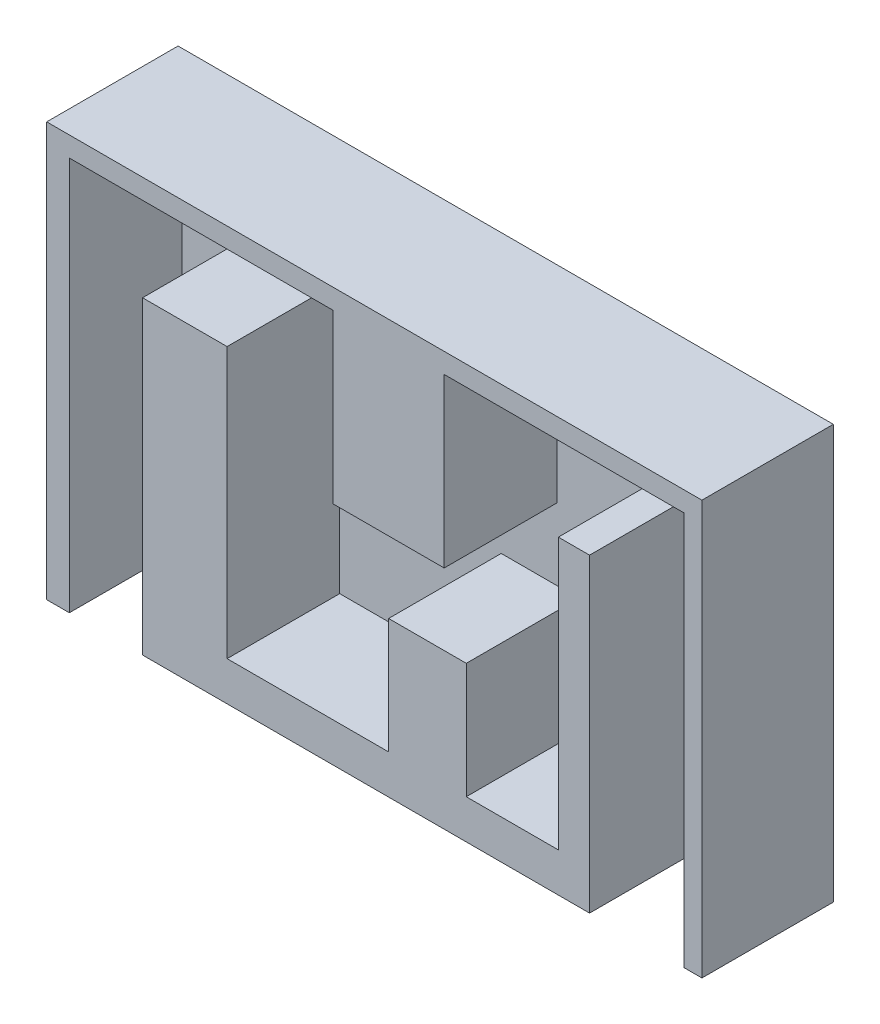
ISO-10303-21;
HEADER;
FILE_DESCRIPTION(('STEP AP214'),'2;1');
FILE_NAME('part.step','',(''),(''),'','','');
FILE_SCHEMA(('AUTOMOTIVE_DESIGN { 1 0 10303 214 1 1 1 1 }'));
ENDSEC;
DATA;
#1=APPLICATION_CONTEXT('core data for automotive mechanical design processes');
#2=APPLICATION_PROTOCOL_DEFINITION('international standard','automotive_design',2000,#1);
#3=PRODUCT_CONTEXT('',#1,'mechanical');
#4=PRODUCT('Part','Part','',(#3));
#5=PRODUCT_RELATED_PRODUCT_CATEGORY('part','',(#4));
#6=PRODUCT_DEFINITION_FORMATION('','',#4);
#7=PRODUCT_DEFINITION_CONTEXT('part definition',#1,'design');
#8=PRODUCT_DEFINITION('design','',#6,#7);
#9=PRODUCT_DEFINITION_SHAPE('','',#8);
#10=(LENGTH_UNIT() NAMED_UNIT(*) SI_UNIT(.MILLI.,.METRE.));
#11=(NAMED_UNIT(*) PLANE_ANGLE_UNIT() SI_UNIT($,.RADIAN.));
#12=(NAMED_UNIT(*) SI_UNIT($,.STERADIAN.) SOLID_ANGLE_UNIT());
#13=UNCERTAINTY_MEASURE_WITH_UNIT(LENGTH_MEASURE(1.E-05),#10,'distance_accuracy_value','');
#14=(GEOMETRIC_REPRESENTATION_CONTEXT(3) GLOBAL_UNCERTAINTY_ASSIGNED_CONTEXT((#13)) GLOBAL_UNIT_ASSIGNED_CONTEXT((#10,
#11,#12)) REPRESENTATION_CONTEXT('',''));
#15=CARTESIAN_POINT('',(0.,0.,0.));
#16=DIRECTION('',(0.,0.,1.));
#17=DIRECTION('',(1.,0.,0.));
#18=AXIS2_PLACEMENT_3D('',#15,#16,#17);
#19=CARTESIAN_POINT('',(0.,0.,500.));
#20=DIRECTION('',(0.,0.,1.));
#21=DIRECTION('',(1.,0.,0.));
#22=AXIS2_PLACEMENT_3D('',#19,#20,#21);
#23=PLANE('',#22);
#24=DIRECTION('',(1.,0.,0.));
#25=VECTOR('',#24,1.);
#26=CARTESIAN_POINT('',(-8052.537291545,-6025.89200004877,500.));
#27=LINE('',#26,#25);
#28=CARTESIAN_POINT('',(-7448.80738329557,-6025.89200004877,500.));
#29=VERTEX_POINT('',#28);
#30=CARTESIAN_POINT('',(-5498.847673456,-6025.89200004877,500.));
#31=VERTEX_POINT('',#30);
#32=EDGE_CURVE('E314',#29,#31,#27,.T.);
#33=ORIENTED_EDGE('',*,*,#32,.T.);
#34=DIRECTION('',(0.,-1.,0.));
#35=VECTOR('',#34,1.);
#36=CARTESIAN_POINT('',(-5498.847673456,-6025.89200004877,500.));
#37=LINE('',#36,#35);
#38=CARTESIAN_POINT('',(-5498.847673456,2217.4300417054,500.));
#39=VERTEX_POINT('',#38);
#40=EDGE_CURVE('E220',#39,#31,#37,.T.);
#41=ORIENTED_EDGE('',*,*,#40,.F.);
#42=DIRECTION('',(-1.,0.,0.));
#43=VECTOR('',#42,1.);
#44=CARTESIAN_POINT('',(-5498.847673456,2217.4300417054,500.));
#45=LINE('',#44,#43);
#46=CARTESIAN_POINT('',(-3246.47736203018,2217.4300417054,500.));
#47=VERTEX_POINT('',#46);
#48=EDGE_CURVE('E216',#47,#39,#45,.T.);
#49=ORIENTED_EDGE('',*,*,#48,.F.);
#50=DIRECTION('',(0.,1.,0.));
#51=VECTOR('',#50,1.);
#52=CARTESIAN_POINT('',(-3246.47736203018,-4983.03292566058,500.));
#53=LINE('',#52,#51);
#54=CARTESIAN_POINT('',(-3246.47736203018,-4983.03292566058,500.));
#55=VERTEX_POINT('',#54);
#56=EDGE_CURVE('E565',#55,#47,#53,.T.);
#57=ORIENTED_EDGE('',*,*,#56,.F.);
#58=DIRECTION('',(-1.,0.,0.));
#59=VECTOR('',#58,1.);
#60=CARTESIAN_POINT('',(-3246.47736203018,-4983.03292566058,500.));
#61=LINE('',#60,#59);
#62=CARTESIAN_POINT('',(1056.62484068523,-4983.03292566058,500.));
#63=VERTEX_POINT('',#62);
#64=EDGE_CURVE('E586',#63,#55,#61,.T.);
#65=ORIENTED_EDGE('',*,*,#64,.F.);
#66=DIRECTION('',(0.,-1.,0.));
#67=VECTOR('',#66,1.);
#68=CARTESIAN_POINT('',(1056.62484068523,-4983.03292566058,500.));
#69=LINE('',#68,#67);
#70=CARTESIAN_POINT('',(1056.62484068523,-1904.23097917169,500.));
#71=VERTEX_POINT('',#70);
#72=EDGE_CURVE('E584',#71,#63,#69,.T.);
#73=ORIENTED_EDGE('',*,*,#72,.F.);
#74=DIRECTION('',(-1.,0.,0.));
#75=VECTOR('',#74,1.);
#76=CARTESIAN_POINT('',(1056.62484068523,-1904.23097917169,500.));
#77=LINE('',#76,#75);
#78=CARTESIAN_POINT('',(3125.30623179592,-1904.23097917169,500.));
#79=VERTEX_POINT('',#78);
#80=EDGE_CURVE('E582',#79,#71,#77,.T.);
#81=ORIENTED_EDGE('',*,*,#80,.F.);
#82=DIRECTION('',(0.,1.,0.));
#83=VECTOR('',#82,1.);
#84=CARTESIAN_POINT('',(3125.30623179592,-4983.03292566058,500.));
#85=LINE('',#84,#83);
#86=CARTESIAN_POINT('',(3125.30623179592,-4983.03292566058,500.));
#87=VERTEX_POINT('',#86);
#88=EDGE_CURVE('E580',#87,#79,#85,.T.);
#89=ORIENTED_EDGE('',*,*,#88,.F.);
#90=DIRECTION('',(-1.,0.,0.));
#91=VECTOR('',#90,1.);
#92=CARTESIAN_POINT('',(3125.30623179592,-4983.03292566058,500.));
#93=LINE('',#92,#91);
#94=CARTESIAN_POINT('',(5578.01974125755,-4983.03292566058,500.));
#95=VERTEX_POINT('',#94);
#96=EDGE_CURVE('E578',#95,#87,#93,.T.);
#97=ORIENTED_EDGE('',*,*,#96,.F.);
#98=DIRECTION('',(0.,-1.,0.));
#99=VECTOR('',#98,1.);
#100=CARTESIAN_POINT('',(5578.01974125755,-4983.03292566058,500.));
#101=LINE('',#100,#99);
#102=CARTESIAN_POINT('',(5578.01974125755,2233.23141171473,500.));
#103=VERTEX_POINT('',#102);
#104=EDGE_CURVE('E576',#103,#95,#101,.T.);
#105=ORIENTED_EDGE('',*,*,#104,.F.);
#106=DIRECTION('',(-1.,0.,0.));
#107=VECTOR('',#106,1.);
#108=CARTESIAN_POINT('',(6409.75472553788,2233.23141171473,500.));
#109=LINE('',#108,#107);
#110=CARTESIAN_POINT('',(6409.75472553788,2233.23141171473,500.));
#111=VERTEX_POINT('',#110);
#112=EDGE_CURVE('E570',#111,#103,#109,.T.);
#113=ORIENTED_EDGE('',*,*,#112,.F.);
#114=DIRECTION('',(0.,1.,0.));
#115=VECTOR('',#114,1.);
#116=CARTESIAN_POINT('',(6409.75472553788,-4983.03292566058,500.));
#117=LINE('',#116,#115);
#118=CARTESIAN_POINT('',(6409.75472553788,-6025.89200004877,500.));
#119=VERTEX_POINT('',#118);
#120=EDGE_CURVE('E568',#119,#111,#117,.T.);
#121=ORIENTED_EDGE('',*,*,#120,.F.);
#122=CARTESIAN_POINT('',(8924.38870667759,-6025.89200004877,500.));
#123=VERTEX_POINT('',#122);
#124=EDGE_CURVE('E36',#119,#123,#27,.T.);
#125=ORIENTED_EDGE('',*,*,#124,.T.);
#126=DIRECTION('',(0.,-1.,0.));
#127=VECTOR('',#126,1.);
#128=CARTESIAN_POINT('',(8924.38870667759,4466.46282342947,500.));
#129=LINE('',#128,#127);
#130=CARTESIAN_POINT('',(8924.38870667759,4466.46282342947,500.));
#131=VERTEX_POINT('',#130);
#132=EDGE_CURVE('E58',#131,#123,#129,.T.);
#133=ORIENTED_EDGE('',*,*,#132,.F.);
#134=DIRECTION('',(1.,0.,0.));
#135=VECTOR('',#134,1.);
#136=CARTESIAN_POINT('',(2536.68679127433,4466.46282342947,500.));
#137=LINE('',#136,#135);
#138=CARTESIAN_POINT('',(2536.68679127433,4466.46282342947,500.));
#139=VERTEX_POINT('',#138);
#140=EDGE_CURVE('E271',#139,#131,#137,.T.);
#141=ORIENTED_EDGE('',*,*,#140,.F.);
#142=DIRECTION('',(0.,1.,0.));
#143=VECTOR('',#142,1.);
#144=CARTESIAN_POINT('',(2536.68679127433,4466.46282342947,500.));
#145=LINE('',#144,#143);
#146=CARTESIAN_POINT('',(2536.68679127433,0.,500.));
#147=VERTEX_POINT('',#146);
#148=EDGE_CURVE('E268',#147,#139,#145,.T.);
#149=ORIENTED_EDGE('',*,*,#148,.F.);
#150=DIRECTION('',(1.,0.,0.));
#151=VECTOR('',#150,1.);
#152=CARTESIAN_POINT('',(-423.437109903873,0.,500.));
#153=LINE('',#152,#151);
#154=CARTESIAN_POINT('',(-423.437109903873,0.,500.));
#155=VERTEX_POINT('',#154);
#156=EDGE_CURVE('E265',#155,#147,#153,.T.);
#157=ORIENTED_EDGE('',*,*,#156,.F.);
#158=DIRECTION('',(0.,-1.,0.));
#159=VECTOR('',#158,1.);
#160=CARTESIAN_POINT('',(-423.437109903873,4466.46282342947,500.));
#161=LINE('',#160,#159);
#162=CARTESIAN_POINT('',(-423.437109903873,4466.46282342947,500.));
#163=VERTEX_POINT('',#162);
#164=EDGE_CURVE('E262',#163,#155,#161,.T.);
#165=ORIENTED_EDGE('',*,*,#164,.F.);
#166=DIRECTION('',(1.,0.,0.));
#167=VECTOR('',#166,1.);
#168=CARTESIAN_POINT('',(-7448.80738329557,4466.46282342947,500.));
#169=LINE('',#168,#167);
#170=CARTESIAN_POINT('',(-7448.80738329557,4466.46282342947,500.));
#171=VERTEX_POINT('',#170);
#172=EDGE_CURVE('E225',#171,#163,#169,.T.);
#173=ORIENTED_EDGE('',*,*,#172,.F.);
#174=DIRECTION('',(0.,1.,0.));
#175=VECTOR('',#174,1.);
#176=CARTESIAN_POINT('',(-7448.80738329557,-6025.89200004877,500.));
#177=LINE('',#176,#175);
#178=EDGE_CURVE('E222',#29,#171,#177,.T.);
#179=ORIENTED_EDGE('',*,*,#178,.F.);
#180=EDGE_LOOP('',(#33,#41,#49,#57,#65,#73,#81,#89,#97,#105,#113,#121,#125,#133,#141,#149,#157,
#165,#173,#179));
#181=FACE_BOUND('',#180,.T.);
#182=ADVANCED_FACE('F32',(#181),#23,.T.);
#183=CARTESIAN_POINT('',(-8052.537291545,4999.05838569069,500.));
#184=DIRECTION('',(1.,0.,0.));
#185=DIRECTION('',(0.,0.,-1.));
#186=AXIS2_PLACEMENT_3D('',#183,#184,#185);
#187=PLANE('',#186);
#188=DIRECTION('',(0.,-1.,0.));
#189=VECTOR('',#188,1.);
#190=CARTESIAN_POINT('',(-8052.537291545,4999.05838569069,0.));
#191=LINE('',#190,#189);
#192=CARTESIAN_POINT('',(-8052.537291545,4999.05838569069,0.));
#193=VERTEX_POINT('',#192);
#194=CARTESIAN_POINT('',(-8052.537291545,-6025.89200004877,0.));
#195=VERTEX_POINT('',#194);
#196=EDGE_CURVE('E310',#193,#195,#191,.T.);
#197=ORIENTED_EDGE('',*,*,#196,.T.);
#198=DIRECTION('',(0.,0.,-1.));
#199=VECTOR('',#198,1.);
#200=CARTESIAN_POINT('',(-8052.537291545,-6025.89200004877,500.));
#201=LINE('',#200,#199);
#202=CARTESIAN_POINT('',(-8052.537291545,-6025.89200004877,3500.));
#203=VERTEX_POINT('',#202);
#204=EDGE_CURVE('E11',#203,#195,#201,.T.);
#205=ORIENTED_EDGE('',*,*,#204,.F.);
#206=DIRECTION('',(0.,-1.,0.));
#207=VECTOR('',#206,1.);
#208=CARTESIAN_POINT('',(-8052.537291545,-6025.89200004877,3500.));
#209=LINE('',#208,#207);
#210=CARTESIAN_POINT('',(-8052.537291545,4999.05838569069,3500.));
#211=VERTEX_POINT('',#210);
#212=EDGE_CURVE('E231',#211,#203,#209,.T.);
#213=ORIENTED_EDGE('',*,*,#212,.F.);
#214=DIRECTION('',(0.,0.,-1.));
#215=VECTOR('',#214,1.);
#216=CARTESIAN_POINT('',(-8052.537291545,4999.05838569069,500.));
#217=LINE('',#216,#215);
#218=EDGE_CURVE('E315',#211,#193,#217,.T.);
#219=ORIENTED_EDGE('',*,*,#218,.T.);
#220=EDGE_LOOP('',(#197,#205,#213,#219));
#221=FACE_BOUND('',#220,.T.);
#222=ADVANCED_FACE('F34',(#221),#187,.F.);
#223=CARTESIAN_POINT('',(-8052.537291545,-6025.89200004877,500.));
#224=DIRECTION('',(0.,1.,0.));
#225=DIRECTION('',(0.,0.,1.));
#226=AXIS2_PLACEMENT_3D('',#223,#224,#225);
#227=PLANE('',#226);
#228=DIRECTION('',(1.,0.,0.));
#229=VECTOR('',#228,1.);
#230=CARTESIAN_POINT('',(-8052.537291545,-6025.89200004877,0.));
#231=LINE('',#230,#229);
#232=CARTESIAN_POINT('',(9403.63415254248,-6025.89200004877,0.));
#233=VERTEX_POINT('',#232);
#234=EDGE_CURVE('E324',#195,#233,#231,.T.);
#235=ORIENTED_EDGE('',*,*,#234,.T.);
#236=DIRECTION('',(0.,0.,-1.));
#237=VECTOR('',#236,1.);
#238=CARTESIAN_POINT('',(9403.63415254248,-6025.89200004877,500.));
#239=LINE('',#238,#237);
#240=CARTESIAN_POINT('',(9403.63415254248,-6025.89200004877,3500.));
#241=VERTEX_POINT('',#240);
#242=EDGE_CURVE('E42',#241,#233,#239,.T.);
#243=ORIENTED_EDGE('',*,*,#242,.F.);
#244=DIRECTION('',(1.,0.,0.));
#245=VECTOR('',#244,1.);
#246=CARTESIAN_POINT('',(9403.63415254248,-6025.89200004877,3500.));
#247=LINE('',#246,#245);
#248=CARTESIAN_POINT('',(8924.38870667759,-6025.89200004877,3500.));
#249=VERTEX_POINT('',#248);
#250=EDGE_CURVE('E250',#249,#241,#247,.T.);
#251=ORIENTED_EDGE('',*,*,#250,.F.);
#252=DIRECTION('',(0.,0.,-1.));
#253=VECTOR('',#252,1.);
#254=CARTESIAN_POINT('',(8924.38870667759,-6025.89200004877,3500.));
#255=LINE('',#254,#253);
#256=EDGE_CURVE('E259',#249,#123,#255,.T.);
#257=ORIENTED_EDGE('',*,*,#256,.T.);
#258=ORIENTED_EDGE('',*,*,#124,.F.);
#259=DIRECTION('',(0.,0.,-1.));
#260=VECTOR('',#259,1.);
#261=CARTESIAN_POINT('',(6409.75472553788,-6025.89200004877,3500.));
#262=LINE('',#261,#260);
#263=CARTESIAN_POINT('',(6409.75472553788,-6025.89200004877,3500.));
#264=VERTEX_POINT('',#263);
#265=EDGE_CURVE('E204',#264,#119,#262,.T.);
#266=ORIENTED_EDGE('',*,*,#265,.F.);
#267=DIRECTION('',(1.,0.,0.));
#268=VECTOR('',#267,1.);
#269=CARTESIAN_POINT('',(-5498.847673456,-6025.89200004877,3500.));
#270=LINE('',#269,#268);
#271=CARTESIAN_POINT('',(-5498.847673456,-6025.89200004877,3500.));
#272=VERTEX_POINT('',#271);
#273=EDGE_CURVE('E196',#272,#264,#270,.T.);
#274=ORIENTED_EDGE('',*,*,#273,.F.);
#275=DIRECTION('',(0.,0.,-1.));
#276=VECTOR('',#275,1.);
#277=CARTESIAN_POINT('',(-5498.847673456,-6025.89200004877,3500.));
#278=LINE('',#277,#276);
#279=EDGE_CURVE('E201',#272,#31,#278,.T.);
#280=ORIENTED_EDGE('',*,*,#279,.T.);
#281=ORIENTED_EDGE('',*,*,#32,.F.);
#282=DIRECTION('',(0.,0.,-1.));
#283=VECTOR('',#282,1.);
#284=CARTESIAN_POINT('',(-7448.80738329557,-6025.89200004877,3500.));
#285=LINE('',#284,#283);
#286=CARTESIAN_POINT('',(-7448.80738329557,-6025.89200004877,3500.));
#287=VERTEX_POINT('',#286);
#288=EDGE_CURVE('E307',#287,#29,#285,.T.);
#289=ORIENTED_EDGE('',*,*,#288,.F.);
#290=DIRECTION('',(1.,0.,0.));
#291=VECTOR('',#290,1.);
#292=CARTESIAN_POINT('',(-8052.537291545,-6025.89200004877,3500.));
#293=LINE('',#292,#291);
#294=EDGE_CURVE('E234',#203,#287,#293,.T.);
#295=ORIENTED_EDGE('',*,*,#294,.F.);
#296=ORIENTED_EDGE('',*,*,#204,.T.);
#297=EDGE_LOOP('',(#235,#243,#251,#257,#258,#266,#274,#280,#281,#289,#295,#296));
#298=FACE_BOUND('',#297,.T.);
#299=ADVANCED_FACE('F198',(#298),#227,.F.);
#300=CARTESIAN_POINT('',(9403.63415254248,4999.05838569069,500.));
#301=DIRECTION('',(-1.,0.,0.));
#302=DIRECTION('',(0.,0.,1.));
#303=AXIS2_PLACEMENT_3D('',#300,#301,#302);
#304=PLANE('',#303);
#305=DIRECTION('',(0.,1.,0.));
#306=VECTOR('',#305,1.);
#307=CARTESIAN_POINT('',(9403.63415254248,4999.05838569069,0.));
#308=LINE('',#307,#306);
#309=CARTESIAN_POINT('',(9403.63415254248,4999.05838569069,0.));
#310=VERTEX_POINT('',#309);
#311=EDGE_CURVE('E328',#233,#310,#308,.T.);
#312=ORIENTED_EDGE('',*,*,#311,.T.);
#313=DIRECTION('',(0.,0.,-1.));
#314=VECTOR('',#313,1.);
#315=CARTESIAN_POINT('',(9403.63415254248,4999.05838569069,500.));
#316=LINE('',#315,#314);
#317=CARTESIAN_POINT('',(9403.63415254248,4999.05838569069,3500.));
#318=VERTEX_POINT('',#317);
#319=EDGE_CURVE('E335',#318,#310,#316,.T.);
#320=ORIENTED_EDGE('',*,*,#319,.F.);
#321=DIRECTION('',(0.,1.,0.));
#322=VECTOR('',#321,1.);
#323=CARTESIAN_POINT('',(9403.63415254248,4466.46282342947,3500.));
#324=LINE('',#323,#322);
#325=EDGE_CURVE('E253',#241,#318,#324,.T.);
#326=ORIENTED_EDGE('',*,*,#325,.F.);
#327=ORIENTED_EDGE('',*,*,#242,.T.);
#328=EDGE_LOOP('',(#312,#320,#326,#327));
#329=FACE_BOUND('',#328,.T.);
#330=ADVANCED_FACE('F340',(#329),#304,.F.);
#331=CARTESIAN_POINT('',(-8052.537291545,4999.05838569069,500.));
#332=DIRECTION('',(0.,-1.,0.));
#333=DIRECTION('',(0.,0.,-1.));
#334=AXIS2_PLACEMENT_3D('',#331,#332,#333);
#335=PLANE('',#334);
#336=DIRECTION('',(-1.,0.,0.));
#337=VECTOR('',#336,1.);
#338=CARTESIAN_POINT('',(-8052.537291545,4999.05838569069,0.));
#339=LINE('',#338,#337);
#340=EDGE_CURVE('E330',#310,#193,#339,.T.);
#341=ORIENTED_EDGE('',*,*,#340,.T.);
#342=ORIENTED_EDGE('',*,*,#218,.F.);
#343=DIRECTION('',(-1.,0.,0.));
#344=VECTOR('',#343,1.);
#345=CARTESIAN_POINT('',(-7448.80738329557,4999.05838569069,3500.));
#346=LINE('',#345,#344);
#347=EDGE_CURVE('E256',#318,#211,#346,.T.);
#348=ORIENTED_EDGE('',*,*,#347,.F.);
#349=ORIENTED_EDGE('',*,*,#319,.T.);
#350=EDGE_LOOP('',(#341,#342,#348,#349));
#351=FACE_BOUND('',#350,.T.);
#352=ADVANCED_FACE('F345',(#351),#335,.F.);
#353=CARTESIAN_POINT('',(0.,0.,0.));
#354=DIRECTION('',(0.,0.,1.));
#355=DIRECTION('',(1.,0.,0.));
#356=AXIS2_PLACEMENT_3D('',#353,#354,#355);
#357=PLANE('',#356);
#358=ORIENTED_EDGE('',*,*,#196,.F.);
#359=ORIENTED_EDGE('',*,*,#340,.F.);
#360=ORIENTED_EDGE('',*,*,#311,.F.);
#361=ORIENTED_EDGE('',*,*,#234,.F.);
#362=EDGE_LOOP('',(#358,#359,#360,#361));
#363=FACE_BOUND('',#362,.T.);
#364=ADVANCED_FACE('F343',(#363),#357,.F.);
#365=CARTESIAN_POINT('',(-7448.80738329557,-6025.89200004877,3500.));
#366=DIRECTION('',(-1.,0.,0.));
#367=DIRECTION('',(0.,0.,1.));
#368=AXIS2_PLACEMENT_3D('',#365,#366,#367);
#369=PLANE('',#368);
#370=ORIENTED_EDGE('',*,*,#178,.T.);
#371=DIRECTION('',(0.,0.,-1.));
#372=VECTOR('',#371,1.);
#373=CARTESIAN_POINT('',(-7448.80738329557,4466.46282342947,3500.));
#374=LINE('',#373,#372);
#375=CARTESIAN_POINT('',(-7448.80738329557,4466.46282342947,3500.));
#376=VERTEX_POINT('',#375);
#377=EDGE_CURVE('E305',#376,#171,#374,.T.);
#378=ORIENTED_EDGE('',*,*,#377,.F.);
#379=DIRECTION('',(0.,1.,0.));
#380=VECTOR('',#379,1.);
#381=CARTESIAN_POINT('',(-7448.80738329557,-6025.89200004877,3500.));
#382=LINE('',#381,#380);
#383=EDGE_CURVE('E236',#287,#376,#382,.T.);
#384=ORIENTED_EDGE('',*,*,#383,.F.);
#385=ORIENTED_EDGE('',*,*,#288,.T.);
#386=EDGE_LOOP('',(#370,#378,#384,#385));
#387=FACE_BOUND('',#386,.T.);
#388=ADVANCED_FACE('F369',(#387),#369,.F.);
#389=CARTESIAN_POINT('',(-7448.80738329557,4466.46282342947,3500.));
#390=DIRECTION('',(0.,1.,0.));
#391=DIRECTION('',(0.,0.,1.));
#392=AXIS2_PLACEMENT_3D('',#389,#390,#391);
#393=PLANE('',#392);
#394=ORIENTED_EDGE('',*,*,#172,.T.);
#395=DIRECTION('',(0.,0.,-1.));
#396=VECTOR('',#395,1.);
#397=CARTESIAN_POINT('',(-423.437109903873,4466.46282342947,3500.));
#398=LINE('',#397,#396);
#399=CARTESIAN_POINT('',(-423.437109903873,4466.46282342947,3500.));
#400=VERTEX_POINT('',#399);
#401=EDGE_CURVE('E302',#400,#163,#398,.T.);
#402=ORIENTED_EDGE('',*,*,#401,.F.);
#403=DIRECTION('',(1.,0.,0.));
#404=VECTOR('',#403,1.);
#405=CARTESIAN_POINT('',(-7448.80738329557,4466.46282342947,3500.));
#406=LINE('',#405,#404);
#407=EDGE_CURVE('E238',#376,#400,#406,.T.);
#408=ORIENTED_EDGE('',*,*,#407,.F.);
#409=ORIENTED_EDGE('',*,*,#377,.T.);
#410=EDGE_LOOP('',(#394,#402,#408,#409));
#411=FACE_BOUND('',#410,.T.);
#412=ADVANCED_FACE('F399',(#411),#393,.F.);
#413=CARTESIAN_POINT('',(-423.437109903873,4466.46282342947,3500.));
#414=DIRECTION('',(1.,0.,0.));
#415=DIRECTION('',(0.,0.,-1.));
#416=AXIS2_PLACEMENT_3D('',#413,#414,#415);
#417=PLANE('',#416);
#418=ORIENTED_EDGE('',*,*,#164,.T.);
#419=DIRECTION('',(0.,0.,-1.));
#420=VECTOR('',#419,1.);
#421=CARTESIAN_POINT('',(-423.437109903873,0.,3500.));
#422=LINE('',#421,#420);
#423=CARTESIAN_POINT('',(-423.437109903873,0.,3500.));
#424=VERTEX_POINT('',#423);
#425=EDGE_CURVE('E297',#424,#155,#422,.T.);
#426=ORIENTED_EDGE('',*,*,#425,.F.);
#427=DIRECTION('',(0.,-1.,0.));
#428=VECTOR('',#427,1.);
#429=CARTESIAN_POINT('',(-423.437109903873,4466.46282342947,3500.));
#430=LINE('',#429,#428);
#431=EDGE_CURVE('E240',#400,#424,#430,.T.);
#432=ORIENTED_EDGE('',*,*,#431,.F.);
#433=ORIENTED_EDGE('',*,*,#401,.T.);
#434=EDGE_LOOP('',(#418,#426,#432,#433));
#435=FACE_BOUND('',#434,.T.);
#436=ADVANCED_FACE('F405',(#435),#417,.F.);
#437=CARTESIAN_POINT('',(-423.437109903873,0.,3500.));
#438=DIRECTION('',(0.,1.,0.));
#439=DIRECTION('',(0.,0.,1.));
#440=AXIS2_PLACEMENT_3D('',#437,#438,#439);
#441=PLANE('',#440);
#442=ORIENTED_EDGE('',*,*,#156,.T.);
#443=DIRECTION('',(0.,0.,-1.));
#444=VECTOR('',#443,1.);
#445=CARTESIAN_POINT('',(2536.68679127433,0.,3500.));
#446=LINE('',#445,#444);
#447=CARTESIAN_POINT('',(2536.68679127433,0.,3500.));
#448=VERTEX_POINT('',#447);
#449=EDGE_CURVE('E292',#448,#147,#446,.T.);
#450=ORIENTED_EDGE('',*,*,#449,.F.);
#451=DIRECTION('',(1.,0.,0.));
#452=VECTOR('',#451,1.);
#453=CARTESIAN_POINT('',(-423.437109903873,0.,3500.));
#454=LINE('',#453,#452);
#455=EDGE_CURVE('E242',#424,#448,#454,.T.);
#456=ORIENTED_EDGE('',*,*,#455,.F.);
#457=ORIENTED_EDGE('',*,*,#425,.T.);
#458=EDGE_LOOP('',(#442,#450,#456,#457));
#459=FACE_BOUND('',#458,.T.);
#460=ADVANCED_FACE('F412',(#459),#441,.F.);
#461=CARTESIAN_POINT('',(2536.68679127433,4466.46282342947,3500.));
#462=DIRECTION('',(-1.,0.,0.));
#463=DIRECTION('',(0.,0.,1.));
#464=AXIS2_PLACEMENT_3D('',#461,#462,#463);
#465=PLANE('',#464);
#466=ORIENTED_EDGE('',*,*,#148,.T.);
#467=DIRECTION('',(0.,0.,-1.));
#468=VECTOR('',#467,1.);
#469=CARTESIAN_POINT('',(2536.68679127433,4466.46282342947,3500.));
#470=LINE('',#469,#468);
#471=CARTESIAN_POINT('',(2536.68679127433,4466.46282342947,3500.));
#472=VERTEX_POINT('',#471);
#473=EDGE_CURVE('E287',#472,#139,#470,.T.);
#474=ORIENTED_EDGE('',*,*,#473,.F.);
#475=DIRECTION('',(0.,1.,0.));
#476=VECTOR('',#475,1.);
#477=CARTESIAN_POINT('',(2536.68679127433,4466.46282342947,3500.));
#478=LINE('',#477,#476);
#479=EDGE_CURVE('E244',#448,#472,#478,.T.);
#480=ORIENTED_EDGE('',*,*,#479,.F.);
#481=ORIENTED_EDGE('',*,*,#449,.T.);
#482=EDGE_LOOP('',(#466,#474,#480,#481));
#483=FACE_BOUND('',#482,.T.);
#484=ADVANCED_FACE('F360',(#483),#465,.F.);
#485=CARTESIAN_POINT('',(2536.68679127433,4466.46282342947,3500.));
#486=DIRECTION('',(0.,1.,0.));
#487=DIRECTION('',(0.,0.,1.));
#488=AXIS2_PLACEMENT_3D('',#485,#486,#487);
#489=PLANE('',#488);
#490=ORIENTED_EDGE('',*,*,#140,.T.);
#491=DIRECTION('',(0.,0.,-1.));
#492=VECTOR('',#491,1.);
#493=CARTESIAN_POINT('',(8924.38870667759,4466.46282342947,3500.));
#494=LINE('',#493,#492);
#495=CARTESIAN_POINT('',(8924.38870667759,4466.46282342947,3500.));
#496=VERTEX_POINT('',#495);
#497=EDGE_CURVE('E275',#496,#131,#494,.T.);
#498=ORIENTED_EDGE('',*,*,#497,.F.);
#499=DIRECTION('',(1.,0.,0.));
#500=VECTOR('',#499,1.);
#501=CARTESIAN_POINT('',(2536.68679127433,4466.46282342947,3500.));
#502=LINE('',#501,#500);
#503=EDGE_CURVE('E246',#472,#496,#502,.T.);
#504=ORIENTED_EDGE('',*,*,#503,.F.);
#505=ORIENTED_EDGE('',*,*,#473,.T.);
#506=EDGE_LOOP('',(#490,#498,#504,#505));
#507=FACE_BOUND('',#506,.T.);
#508=ADVANCED_FACE('F353',(#507),#489,.F.);
#509=CARTESIAN_POINT('',(8924.38870667759,4466.46282342947,3500.));
#510=DIRECTION('',(1.,0.,0.));
#511=DIRECTION('',(0.,0.,-1.));
#512=AXIS2_PLACEMENT_3D('',#509,#510,#511);
#513=PLANE('',#512);
#514=ORIENTED_EDGE('',*,*,#132,.T.);
#515=ORIENTED_EDGE('',*,*,#256,.F.);
#516=DIRECTION('',(0.,-1.,0.));
#517=VECTOR('',#516,1.);
#518=CARTESIAN_POINT('',(8924.38870667759,4466.46282342947,3500.));
#519=LINE('',#518,#517);
#520=EDGE_CURVE('E248',#496,#249,#519,.T.);
#521=ORIENTED_EDGE('',*,*,#520,.F.);
#522=ORIENTED_EDGE('',*,*,#497,.T.);
#523=EDGE_LOOP('',(#514,#515,#521,#522));
#524=FACE_BOUND('',#523,.T.);
#525=ADVANCED_FACE('F351',(#524),#513,.F.);
#526=CARTESIAN_POINT('',(0.,0.,3500.));
#527=DIRECTION('',(0.,0.,-1.));
#528=DIRECTION('',(-1.,0.,0.));
#529=AXIS2_PLACEMENT_3D('',#526,#527,#528);
#530=PLANE('',#529);
#531=ORIENTED_EDGE('',*,*,#212,.T.);
#532=ORIENTED_EDGE('',*,*,#294,.T.);
#533=ORIENTED_EDGE('',*,*,#383,.T.);
#534=ORIENTED_EDGE('',*,*,#407,.T.);
#535=ORIENTED_EDGE('',*,*,#431,.T.);
#536=ORIENTED_EDGE('',*,*,#455,.T.);
#537=ORIENTED_EDGE('',*,*,#479,.T.);
#538=ORIENTED_EDGE('',*,*,#503,.T.);
#539=ORIENTED_EDGE('',*,*,#520,.T.);
#540=ORIENTED_EDGE('',*,*,#250,.T.);
#541=ORIENTED_EDGE('',*,*,#325,.T.);
#542=ORIENTED_EDGE('',*,*,#347,.T.);
#543=EDGE_LOOP('',(#531,#532,#533,#534,#535,#536,#537,#538,#539,#540,#541,#542));
#544=FACE_BOUND('',#543,.T.);
#545=ADVANCED_FACE('F350',(#544),#530,.F.);
#546=CARTESIAN_POINT('',(-5498.847673456,-6025.89200004877,3500.));
#547=DIRECTION('',(1.,0.,0.));
#548=DIRECTION('',(0.,0.,-1.));
#549=AXIS2_PLACEMENT_3D('',#546,#547,#548);
#550=PLANE('',#549);
#551=ORIENTED_EDGE('',*,*,#40,.T.);
#552=ORIENTED_EDGE('',*,*,#279,.F.);
#553=DIRECTION('',(0.,-1.,0.));
#554=VECTOR('',#553,1.);
#555=CARTESIAN_POINT('',(-5498.847673456,-6025.89200004877,3500.));
#556=LINE('',#555,#554);
#557=CARTESIAN_POINT('',(-5498.847673456,2217.4300417054,3500.));
#558=VERTEX_POINT('',#557);
#559=EDGE_CURVE('E208',#558,#272,#556,.T.);
#560=ORIENTED_EDGE('',*,*,#559,.F.);
#561=DIRECTION('',(0.,0.,-1.));
#562=VECTOR('',#561,1.);
#563=CARTESIAN_POINT('',(-5498.847673456,2217.4300417054,3500.));
#564=LINE('',#563,#562);
#565=EDGE_CURVE('E563',#558,#39,#564,.T.);
#566=ORIENTED_EDGE('',*,*,#565,.T.);
#567=EDGE_LOOP('',(#551,#552,#560,#566));
#568=FACE_BOUND('',#567,.T.);
#569=ADVANCED_FACE('F218',(#568),#550,.F.);
#570=CARTESIAN_POINT('',(6409.75472553788,-4983.03292566058,3500.));
#571=DIRECTION('',(-1.,0.,0.));
#572=DIRECTION('',(0.,0.,1.));
#573=AXIS2_PLACEMENT_3D('',#570,#571,#572);
#574=PLANE('',#573);
#575=ORIENTED_EDGE('',*,*,#120,.T.);
#576=DIRECTION('',(0.,0.,-1.));
#577=VECTOR('',#576,1.);
#578=CARTESIAN_POINT('',(6409.75472553788,2233.23141171473,3500.));
#579=LINE('',#578,#577);
#580=CARTESIAN_POINT('',(6409.75472553788,2233.23141171473,3500.));
#581=VERTEX_POINT('',#580);
#582=EDGE_CURVE('E227',#581,#111,#579,.T.);
#583=ORIENTED_EDGE('',*,*,#582,.F.);
#584=DIRECTION('',(0.,1.,0.));
#585=VECTOR('',#584,1.);
#586=CARTESIAN_POINT('',(6409.75472553788,-4983.03292566058,3500.));
#587=LINE('',#586,#585);
#588=EDGE_CURVE('E207',#264,#581,#587,.T.);
#589=ORIENTED_EDGE('',*,*,#588,.F.);
#590=ORIENTED_EDGE('',*,*,#265,.T.);
#591=EDGE_LOOP('',(#575,#583,#589,#590));
#592=FACE_BOUND('',#591,.T.);
#593=ADVANCED_FACE('F451',(#592),#574,.F.);
#594=CARTESIAN_POINT('',(6409.75472553788,2233.23141171473,3500.));
#595=DIRECTION('',(0.,-1.,0.));
#596=DIRECTION('',(0.,0.,-1.));
#597=AXIS2_PLACEMENT_3D('',#594,#595,#596);
#598=PLANE('',#597);
#599=ORIENTED_EDGE('',*,*,#112,.T.);
#600=DIRECTION('',(0.,0.,-1.));
#601=VECTOR('',#600,1.);
#602=CARTESIAN_POINT('',(5578.01974125755,2233.23141171473,3500.));
#603=LINE('',#602,#601);
#604=CARTESIAN_POINT('',(5578.01974125755,2233.23141171473,3500.));
#605=VERTEX_POINT('',#604);
#606=EDGE_CURVE('E608',#605,#103,#603,.T.);
#607=ORIENTED_EDGE('',*,*,#606,.F.);
#608=DIRECTION('',(-1.,0.,0.));
#609=VECTOR('',#608,1.);
#610=CARTESIAN_POINT('',(6409.75472553788,2233.23141171473,3500.));
#611=LINE('',#610,#609);
#612=EDGE_CURVE('E615',#581,#605,#611,.T.);
#613=ORIENTED_EDGE('',*,*,#612,.F.);
#614=ORIENTED_EDGE('',*,*,#582,.T.);
#615=EDGE_LOOP('',(#599,#607,#613,#614));
#616=FACE_BOUND('',#615,.T.);
#617=ADVANCED_FACE('F461',(#616),#598,.F.);
#618=CARTESIAN_POINT('',(5578.01974125755,-4983.03292566058,3500.));
#619=DIRECTION('',(1.,0.,0.));
#620=DIRECTION('',(0.,0.,-1.));
#621=AXIS2_PLACEMENT_3D('',#618,#619,#620);
#622=PLANE('',#621);
#623=ORIENTED_EDGE('',*,*,#104,.T.);
#624=DIRECTION('',(0.,0.,-1.));
#625=VECTOR('',#624,1.);
#626=CARTESIAN_POINT('',(5578.01974125755,-4983.03292566058,3500.));
#627=LINE('',#626,#625);
#628=CARTESIAN_POINT('',(5578.01974125755,-4983.03292566058,3500.));
#629=VERTEX_POINT('',#628);
#630=EDGE_CURVE('E605',#629,#95,#627,.T.);
#631=ORIENTED_EDGE('',*,*,#630,.F.);
#632=DIRECTION('',(0.,-1.,0.));
#633=VECTOR('',#632,1.);
#634=CARTESIAN_POINT('',(5578.01974125755,-4983.03292566058,3500.));
#635=LINE('',#634,#633);
#636=EDGE_CURVE('E627',#605,#629,#635,.T.);
#637=ORIENTED_EDGE('',*,*,#636,.F.);
#638=ORIENTED_EDGE('',*,*,#606,.T.);
#639=EDGE_LOOP('',(#623,#631,#637,#638));
#640=FACE_BOUND('',#639,.T.);
#641=ADVANCED_FACE('F471',(#640),#622,.F.);
#642=CARTESIAN_POINT('',(3125.30623179592,-4983.03292566058,3500.));
#643=DIRECTION('',(0.,-1.,0.));
#644=DIRECTION('',(0.,0.,-1.));
#645=AXIS2_PLACEMENT_3D('',#642,#643,#644);
#646=PLANE('',#645);
#647=ORIENTED_EDGE('',*,*,#96,.T.);
#648=DIRECTION('',(0.,0.,-1.));
#649=VECTOR('',#648,1.);
#650=CARTESIAN_POINT('',(3125.30623179592,-4983.03292566058,3500.));
#651=LINE('',#650,#649);
#652=CARTESIAN_POINT('',(3125.30623179592,-4983.03292566058,3500.));
#653=VERTEX_POINT('',#652);
#654=EDGE_CURVE('E602',#653,#87,#651,.T.);
#655=ORIENTED_EDGE('',*,*,#654,.F.);
#656=DIRECTION('',(-1.,0.,0.));
#657=VECTOR('',#656,1.);
#658=CARTESIAN_POINT('',(3125.30623179592,-4983.03292566058,3500.));
#659=LINE('',#658,#657);
#660=EDGE_CURVE('E624',#629,#653,#659,.T.);
#661=ORIENTED_EDGE('',*,*,#660,.F.);
#662=ORIENTED_EDGE('',*,*,#630,.T.);
#663=EDGE_LOOP('',(#647,#655,#661,#662));
#664=FACE_BOUND('',#663,.T.);
#665=ADVANCED_FACE('F481',(#664),#646,.F.);
#666=CARTESIAN_POINT('',(3125.30623179592,-4983.03292566058,3500.));
#667=DIRECTION('',(-1.,0.,0.));
#668=DIRECTION('',(0.,0.,1.));
#669=AXIS2_PLACEMENT_3D('',#666,#667,#668);
#670=PLANE('',#669);
#671=ORIENTED_EDGE('',*,*,#88,.T.);
#672=DIRECTION('',(0.,0.,-1.));
#673=VECTOR('',#672,1.);
#674=CARTESIAN_POINT('',(3125.30623179592,-1904.23097917169,3500.));
#675=LINE('',#674,#673);
#676=CARTESIAN_POINT('',(3125.30623179592,-1904.23097917169,3500.));
#677=VERTEX_POINT('',#676);
#678=EDGE_CURVE('E599',#677,#79,#675,.T.);
#679=ORIENTED_EDGE('',*,*,#678,.F.);
#680=DIRECTION('',(0.,1.,0.));
#681=VECTOR('',#680,1.);
#682=CARTESIAN_POINT('',(3125.30623179592,-4983.03292566058,3500.));
#683=LINE('',#682,#681);
#684=EDGE_CURVE('E626',#653,#677,#683,.T.);
#685=ORIENTED_EDGE('',*,*,#684,.F.);
#686=ORIENTED_EDGE('',*,*,#654,.T.);
#687=EDGE_LOOP('',(#671,#679,#685,#686));
#688=FACE_BOUND('',#687,.T.);
#689=ADVANCED_FACE('F491',(#688),#670,.F.);
#690=CARTESIAN_POINT('',(1056.62484068523,-1904.23097917169,3500.));
#691=DIRECTION('',(0.,-1.,0.));
#692=DIRECTION('',(0.,0.,-1.));
#693=AXIS2_PLACEMENT_3D('',#690,#691,#692);
#694=PLANE('',#693);
#695=ORIENTED_EDGE('',*,*,#80,.T.);
#696=DIRECTION('',(0.,0.,-1.));
#697=VECTOR('',#696,1.);
#698=CARTESIAN_POINT('',(1056.62484068523,-1904.23097917169,3500.));
#699=LINE('',#698,#697);
#700=CARTESIAN_POINT('',(1056.62484068523,-1904.23097917169,3500.));
#701=VERTEX_POINT('',#700);
#702=EDGE_CURVE('E596',#701,#71,#699,.T.);
#703=ORIENTED_EDGE('',*,*,#702,.F.);
#704=DIRECTION('',(-1.,0.,0.));
#705=VECTOR('',#704,1.);
#706=CARTESIAN_POINT('',(1056.62484068523,-1904.23097917169,3500.));
#707=LINE('',#706,#705);
#708=EDGE_CURVE('E629',#677,#701,#707,.T.);
#709=ORIENTED_EDGE('',*,*,#708,.F.);
#710=ORIENTED_EDGE('',*,*,#678,.T.);
#711=EDGE_LOOP('',(#695,#703,#709,#710));
#712=FACE_BOUND('',#711,.T.);
#713=ADVANCED_FACE('F501',(#712),#694,.F.);
#714=CARTESIAN_POINT('',(1056.62484068523,-4983.03292566058,3500.));
#715=DIRECTION('',(1.,0.,0.));
#716=DIRECTION('',(0.,0.,-1.));
#717=AXIS2_PLACEMENT_3D('',#714,#715,#716);
#718=PLANE('',#717);
#719=ORIENTED_EDGE('',*,*,#72,.T.);
#720=DIRECTION('',(0.,0.,-1.));
#721=VECTOR('',#720,1.);
#722=CARTESIAN_POINT('',(1056.62484068523,-4983.03292566058,3500.));
#723=LINE('',#722,#721);
#724=CARTESIAN_POINT('',(1056.62484068523,-4983.03292566058,3500.));
#725=VERTEX_POINT('',#724);
#726=EDGE_CURVE('E593',#725,#63,#723,.T.);
#727=ORIENTED_EDGE('',*,*,#726,.F.);
#728=DIRECTION('',(0.,-1.,0.));
#729=VECTOR('',#728,1.);
#730=CARTESIAN_POINT('',(1056.62484068523,-4983.03292566058,3500.));
#731=LINE('',#730,#729);
#732=EDGE_CURVE('E635',#701,#725,#731,.T.);
#733=ORIENTED_EDGE('',*,*,#732,.F.);
#734=ORIENTED_EDGE('',*,*,#702,.T.);
#735=EDGE_LOOP('',(#719,#727,#733,#734));
#736=FACE_BOUND('',#735,.T.);
#737=ADVANCED_FACE('F511',(#736),#718,.F.);
#738=CARTESIAN_POINT('',(-3246.47736203018,-4983.03292566058,3500.));
#739=DIRECTION('',(0.,-1.,0.));
#740=DIRECTION('',(0.,0.,-1.));
#741=AXIS2_PLACEMENT_3D('',#738,#739,#740);
#742=PLANE('',#741);
#743=ORIENTED_EDGE('',*,*,#64,.T.);
#744=DIRECTION('',(0.,0.,-1.));
#745=VECTOR('',#744,1.);
#746=CARTESIAN_POINT('',(-3246.47736203018,-4983.03292566058,3500.));
#747=LINE('',#746,#745);
#748=CARTESIAN_POINT('',(-3246.47736203018,-4983.03292566058,3500.));
#749=VERTEX_POINT('',#748);
#750=EDGE_CURVE('E590',#749,#55,#747,.T.);
#751=ORIENTED_EDGE('',*,*,#750,.F.);
#752=DIRECTION('',(-1.,0.,0.));
#753=VECTOR('',#752,1.);
#754=CARTESIAN_POINT('',(-3246.47736203018,-4983.03292566058,3500.));
#755=LINE('',#754,#753);
#756=EDGE_CURVE('E637',#725,#749,#755,.T.);
#757=ORIENTED_EDGE('',*,*,#756,.F.);
#758=ORIENTED_EDGE('',*,*,#726,.T.);
#759=EDGE_LOOP('',(#743,#751,#757,#758));
#760=FACE_BOUND('',#759,.T.);
#761=ADVANCED_FACE('F521',(#760),#742,.F.);
#762=CARTESIAN_POINT('',(-3246.47736203018,-4983.03292566058,3500.));
#763=DIRECTION('',(-1.,0.,0.));
#764=DIRECTION('',(0.,0.,1.));
#765=AXIS2_PLACEMENT_3D('',#762,#763,#764);
#766=PLANE('',#765);
#767=ORIENTED_EDGE('',*,*,#56,.T.);
#768=DIRECTION('',(0.,0.,-1.));
#769=VECTOR('',#768,1.);
#770=CARTESIAN_POINT('',(-3246.47736203018,2217.4300417054,3500.));
#771=LINE('',#770,#769);
#772=CARTESIAN_POINT('',(-3246.47736203018,2217.4300417054,3500.));
#773=VERTEX_POINT('',#772);
#774=EDGE_CURVE('E50',#773,#47,#771,.T.);
#775=ORIENTED_EDGE('',*,*,#774,.F.);
#776=DIRECTION('',(0.,1.,0.));
#777=VECTOR('',#776,1.);
#778=CARTESIAN_POINT('',(-3246.47736203018,-4983.03292566058,3500.));
#779=LINE('',#778,#777);
#780=EDGE_CURVE('E638',#749,#773,#779,.T.);
#781=ORIENTED_EDGE('',*,*,#780,.F.);
#782=ORIENTED_EDGE('',*,*,#750,.T.);
#783=EDGE_LOOP('',(#767,#775,#781,#782));
#784=FACE_BOUND('',#783,.T.);
#785=ADVANCED_FACE('F531',(#784),#766,.F.);
#786=CARTESIAN_POINT('',(-5498.847673456,2217.4300417054,3500.));
#787=DIRECTION('',(0.,-1.,0.));
#788=DIRECTION('',(0.,0.,-1.));
#789=AXIS2_PLACEMENT_3D('',#786,#787,#788);
#790=PLANE('',#789);
#791=ORIENTED_EDGE('',*,*,#48,.T.);
#792=ORIENTED_EDGE('',*,*,#565,.F.);
#793=DIRECTION('',(-1.,0.,0.));
#794=VECTOR('',#793,1.);
#795=CARTESIAN_POINT('',(-5498.847673456,2217.4300417054,3500.));
#796=LINE('',#795,#794);
#797=EDGE_CURVE('E212',#773,#558,#796,.T.);
#798=ORIENTED_EDGE('',*,*,#797,.F.);
#799=ORIENTED_EDGE('',*,*,#774,.T.);
#800=EDGE_LOOP('',(#791,#792,#798,#799));
#801=FACE_BOUND('',#800,.T.);
#802=ADVANCED_FACE('F541',(#801),#790,.F.);
#803=CARTESIAN_POINT('',(0.,0.,3500.));
#804=DIRECTION('',(0.,0.,-1.));
#805=DIRECTION('',(-1.,0.,0.));
#806=AXIS2_PLACEMENT_3D('',#803,#804,#805);
#807=PLANE('',#806);
#808=ORIENTED_EDGE('',*,*,#559,.T.);
#809=ORIENTED_EDGE('',*,*,#273,.T.);
#810=ORIENTED_EDGE('',*,*,#588,.T.);
#811=ORIENTED_EDGE('',*,*,#612,.T.);
#812=ORIENTED_EDGE('',*,*,#636,.T.);
#813=ORIENTED_EDGE('',*,*,#660,.T.);
#814=ORIENTED_EDGE('',*,*,#684,.T.);
#815=ORIENTED_EDGE('',*,*,#708,.T.);
#816=ORIENTED_EDGE('',*,*,#732,.T.);
#817=ORIENTED_EDGE('',*,*,#756,.T.);
#818=ORIENTED_EDGE('',*,*,#780,.T.);
#819=ORIENTED_EDGE('',*,*,#797,.T.);
#820=EDGE_LOOP('',(#808,#809,#810,#811,#812,#813,#814,#815,#816,#817,#818,#819));
#821=FACE_BOUND('',#820,.T.);
#822=ADVANCED_FACE('F211',(#821),#807,.F.);
#823=CLOSED_SHELL('',(#182,#222,#299,#330,#352,#364,#388,#412,#436,#460,#484,#508,#525,#545,
#569,#593,#617,#641,#665,#689,#713,#737,#761,#785,#802,#822));
#824=MANIFOLD_SOLID_BREP('B2',#823);
#825=ADVANCED_BREP_SHAPE_REPRESENTATION('',(#18,#824),#14);
#826=SHAPE_DEFINITION_REPRESENTATION(#9,#825);
ENDSEC;
END-ISO-10303-21;
